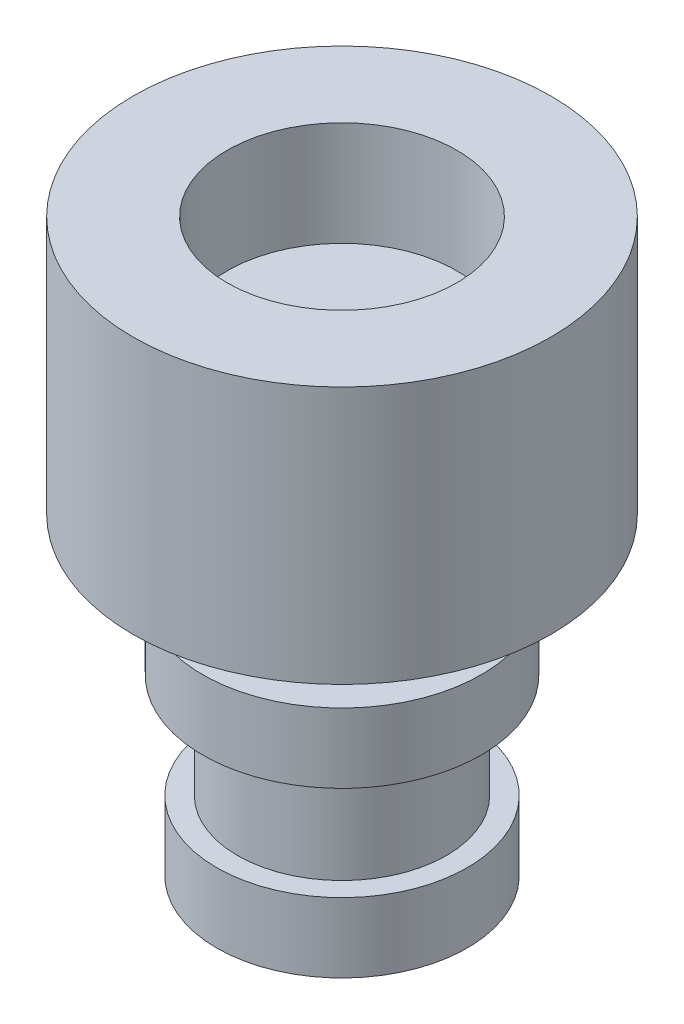
ISO-10303-21;
HEADER;
FILE_DESCRIPTION(('STEP AP214'),'2;1');
FILE_NAME('part.step','',(''),(''),'','','');
FILE_SCHEMA(('AUTOMOTIVE_DESIGN { 1 0 10303 214 1 1 1 1 }'));
ENDSEC;
DATA;
#1=APPLICATION_CONTEXT('core data for automotive mechanical design processes');
#2=APPLICATION_PROTOCOL_DEFINITION('international standard','automotive_design',2000,#1);
#3=PRODUCT_CONTEXT('',#1,'mechanical');
#4=PRODUCT('Part','Part','',(#3));
#5=PRODUCT_RELATED_PRODUCT_CATEGORY('part','',(#4));
#6=PRODUCT_DEFINITION_FORMATION('','',#4);
#7=PRODUCT_DEFINITION_CONTEXT('part definition',#1,'design');
#8=PRODUCT_DEFINITION('design','',#6,#7);
#9=PRODUCT_DEFINITION_SHAPE('','',#8);
#10=(LENGTH_UNIT() NAMED_UNIT(*) SI_UNIT(.MILLI.,.METRE.));
#11=(NAMED_UNIT(*) PLANE_ANGLE_UNIT() SI_UNIT($,.RADIAN.));
#12=(NAMED_UNIT(*) SI_UNIT($,.STERADIAN.) SOLID_ANGLE_UNIT());
#13=UNCERTAINTY_MEASURE_WITH_UNIT(LENGTH_MEASURE(1.E-05),#10,'distance_accuracy_value','');
#14=(GEOMETRIC_REPRESENTATION_CONTEXT(3) GLOBAL_UNCERTAINTY_ASSIGNED_CONTEXT((#13)) GLOBAL_UNIT_ASSIGNED_CONTEXT((#10,
#11,#12)) REPRESENTATION_CONTEXT('',''));
#15=CARTESIAN_POINT('',(0.,0.,0.));
#16=DIRECTION('',(0.,0.,1.));
#17=DIRECTION('',(1.,0.,0.));
#18=AXIS2_PLACEMENT_3D('',#15,#16,#17);
#19=CARTESIAN_POINT('',(-0.522013311509166,-4.5,-0.51113803418606));
#20=DIRECTION('',(0.,1.,0.));
#21=DIRECTION('',(0.,0.,1.));
#22=AXIS2_PLACEMENT_3D('',#19,#20,#21);
#23=CYLINDRICAL_SURFACE('',#22,1.5);
#24=CARTESIAN_POINT('',(-0.522013311509166,-2.,-0.51113803418606));
#25=DIRECTION('',(0.,-1.,0.));
#26=DIRECTION('',(0.,0.,-1.));
#27=AXIS2_PLACEMENT_3D('',#24,#25,#26);
#28=CIRCLE('',#27,1.5);
#29=CARTESIAN_POINT('',(-0.522013311509166,-2.,-2.01113803418606));
#30=VERTEX_POINT('',#29);
#31=EDGE_CURVE('E53',#30,#30,#28,.T.);
#32=ORIENTED_EDGE('',*,*,#31,.T.);
#33=EDGE_LOOP('',(#32));
#34=FACE_BOUND('',#33,.T.);
#35=CARTESIAN_POINT('',(-0.522013311509166,-3.5,-0.51113803418606));
#36=DIRECTION('',(0.,-1.,0.));
#37=DIRECTION('',(0.,0.,-1.));
#38=AXIS2_PLACEMENT_3D('',#35,#36,#37);
#39=CIRCLE('',#38,1.5);
#40=CARTESIAN_POINT('',(-0.522013311509166,-3.5,-2.01113803418606));
#41=VERTEX_POINT('',#40);
#42=EDGE_CURVE('E10',#41,#41,#39,.T.);
#43=ORIENTED_EDGE('',*,*,#42,.F.);
#44=EDGE_LOOP('',(#43));
#45=FACE_BOUND('',#44,.T.);
#46=ADVANCED_FACE('F45',(#34,#45),#23,.T.);
#47=CARTESIAN_POINT('',(-0.522013311509166,3.7,-0.51113803418606));
#48=DIRECTION('',(0.,-1.,0.));
#49=DIRECTION('',(0.,0.,-1.));
#50=AXIS2_PLACEMENT_3D('',#47,#48,#49);
#51=CYLINDRICAL_SURFACE('',#50,3.);
#52=CARTESIAN_POINT('',(-0.522013311509166,3.7,-0.51113803418606));
#53=DIRECTION('',(0.,1.,0.));
#54=DIRECTION('',(0.,0.,1.));
#55=AXIS2_PLACEMENT_3D('',#52,#53,#54);
#56=CIRCLE('',#55,3.);
#57=CARTESIAN_POINT('',(-0.522013311509166,3.7,2.48886196581394));
#58=VERTEX_POINT('',#57);
#59=EDGE_CURVE('E64',#58,#58,#56,.T.);
#60=ORIENTED_EDGE('',*,*,#59,.F.);
#61=EDGE_LOOP('',(#60));
#62=FACE_BOUND('',#61,.T.);
#63=CARTESIAN_POINT('',(-0.522013311509166,0.,-0.51113803418606));
#64=DIRECTION('',(0.,1.,0.));
#65=DIRECTION('',(0.,0.,1.));
#66=AXIS2_PLACEMENT_3D('',#63,#64,#65);
#67=CIRCLE('',#66,3.);
#68=CARTESIAN_POINT('',(-0.522013311509166,0.,2.48886196581394));
#69=VERTEX_POINT('',#68);
#70=EDGE_CURVE('E82',#69,#69,#67,.T.);
#71=ORIENTED_EDGE('',*,*,#70,.T.);
#72=EDGE_LOOP('',(#71));
#73=FACE_BOUND('',#72,.T.);
#74=ADVANCED_FACE('F47',(#62,#73),#51,.T.);
#75=CARTESIAN_POINT('',(-0.522013311509166,3.7,-0.51113803418606));
#76=DIRECTION('',(0.,1.,0.));
#77=DIRECTION('',(0.,0.,1.));
#78=AXIS2_PLACEMENT_3D('',#75,#76,#77);
#79=PLANE('',#78);
#80=CARTESIAN_POINT('',(-0.522013311509166,3.7,-0.51113803418606));
#81=DIRECTION('',(0.,1.,0.));
#82=DIRECTION('',(0.,0.,1.));
#83=AXIS2_PLACEMENT_3D('',#80,#81,#82);
#84=CIRCLE('',#83,1.65);
#85=CARTESIAN_POINT('',(-0.522013311509166,3.7,1.13886196581394));
#86=VERTEX_POINT('',#85);
#87=EDGE_CURVE('E255',#86,#86,#84,.T.);
#88=ORIENTED_EDGE('',*,*,#87,.F.);
#89=EDGE_LOOP('',(#88));
#90=FACE_BOUND('',#89,.T.);
#91=ORIENTED_EDGE('',*,*,#59,.T.);
#92=EDGE_LOOP('',(#91));
#93=FACE_BOUND('',#92,.T.);
#94=ADVANCED_FACE('F94',(#90,#93),#79,.T.);
#95=CARTESIAN_POINT('',(-0.522013311509166,0.,-0.51113803418606));
#96=DIRECTION('',(0.,1.,0.));
#97=DIRECTION('',(0.,0.,1.));
#98=AXIS2_PLACEMENT_3D('',#95,#96,#97);
#99=PLANE('',#98);
#100=CARTESIAN_POINT('',(-0.522013311509166,0.,-0.51113803418606));
#101=DIRECTION('',(0.,-1.,0.));
#102=DIRECTION('',(0.,0.,-1.));
#103=AXIS2_PLACEMENT_3D('',#100,#101,#102);
#104=CIRCLE('',#103,1.5);
#105=CARTESIAN_POINT('',(-0.522013311509166,0.,-2.01113803418606));
#106=VERTEX_POINT('',#105);
#107=EDGE_CURVE('E58',#106,#106,#104,.T.);
#108=ORIENTED_EDGE('',*,*,#107,.F.);
#109=EDGE_LOOP('',(#108));
#110=FACE_BOUND('',#109,.T.);
#111=ORIENTED_EDGE('',*,*,#70,.F.);
#112=EDGE_LOOP('',(#111));
#113=FACE_BOUND('',#112,.T.);
#114=ADVANCED_FACE('F91',(#110,#113),#99,.F.);
#115=CARTESIAN_POINT('',(-0.522013311509166,-1.,-0.51113803418606));
#116=DIRECTION('',(0.,1.,0.));
#117=DIRECTION('',(0.,0.,1.));
#118=AXIS2_PLACEMENT_3D('',#115,#116,#117);
#119=CYLINDRICAL_SURFACE('',#118,1.5);
#120=CARTESIAN_POINT('',(-0.522013311509166,-1.,-0.51113803418606));
#121=DIRECTION('',(0.,-1.,0.));
#122=DIRECTION('',(0.,0.,-1.));
#123=AXIS2_PLACEMENT_3D('',#120,#121,#122);
#124=CIRCLE('',#123,1.5);
#125=CARTESIAN_POINT('',(-0.522013311509166,-1.,-2.01113803418606));
#126=VERTEX_POINT('',#125);
#127=EDGE_CURVE('E74',#126,#126,#124,.T.);
#128=ORIENTED_EDGE('',*,*,#127,.F.);
#129=EDGE_LOOP('',(#128));
#130=FACE_BOUND('',#129,.T.);
#131=ORIENTED_EDGE('',*,*,#107,.T.);
#132=EDGE_LOOP('',(#131));
#133=FACE_BOUND('',#132,.T.);
#134=ADVANCED_FACE('F93',(#130,#133),#119,.T.);
#135=CARTESIAN_POINT('',(-0.522013311509166,-2.,-0.51113803418606));
#136=DIRECTION('',(0.,1.,0.));
#137=DIRECTION('',(0.,0.,1.));
#138=AXIS2_PLACEMENT_3D('',#135,#136,#137);
#139=CYLINDRICAL_SURFACE('',#138,2.);
#140=CARTESIAN_POINT('',(-0.522013311509166,-2.,-0.51113803418606));
#141=DIRECTION('',(0.,-1.,0.));
#142=DIRECTION('',(0.,0.,-1.));
#143=AXIS2_PLACEMENT_3D('',#140,#141,#142);
#144=CIRCLE('',#143,2.);
#145=CARTESIAN_POINT('',(-0.522013311509166,-2.,-2.51113803418606));
#146=VERTEX_POINT('',#145);
#147=EDGE_CURVE('E70',#146,#146,#144,.T.);
#148=ORIENTED_EDGE('',*,*,#147,.F.);
#149=EDGE_LOOP('',(#148));
#150=FACE_BOUND('',#149,.T.);
#151=CARTESIAN_POINT('',(-0.522013311509166,-1.,-0.51113803418606));
#152=DIRECTION('',(0.,-1.,0.));
#153=DIRECTION('',(0.,0.,-1.));
#154=AXIS2_PLACEMENT_3D('',#151,#152,#153);
#155=CIRCLE('',#154,2.);
#156=CARTESIAN_POINT('',(-0.522013311509166,-1.,-2.51113803418606));
#157=VERTEX_POINT('',#156);
#158=EDGE_CURVE('E75',#157,#157,#155,.T.);
#159=ORIENTED_EDGE('',*,*,#158,.T.);
#160=EDGE_LOOP('',(#159));
#161=FACE_BOUND('',#160,.T.);
#162=ADVANCED_FACE('F100',(#150,#161),#139,.T.);
#163=CARTESIAN_POINT('',(-0.522013311509166,-2.,-0.51113803418606));
#164=DIRECTION('',(0.,-1.,0.));
#165=DIRECTION('',(0.,0.,-1.));
#166=AXIS2_PLACEMENT_3D('',#163,#164,#165);
#167=PLANE('',#166);
#168=ORIENTED_EDGE('',*,*,#31,.F.);
#169=EDGE_LOOP('',(#168));
#170=FACE_BOUND('',#169,.T.);
#171=ORIENTED_EDGE('',*,*,#147,.T.);
#172=EDGE_LOOP('',(#171));
#173=FACE_BOUND('',#172,.T.);
#174=ADVANCED_FACE('F117',(#170,#173),#167,.T.);
#175=CARTESIAN_POINT('',(-0.522013311509166,-1.,-0.51113803418606));
#176=DIRECTION('',(0.,-1.,0.));
#177=DIRECTION('',(0.,0.,-1.));
#178=AXIS2_PLACEMENT_3D('',#175,#176,#177);
#179=PLANE('',#178);
#180=ORIENTED_EDGE('',*,*,#127,.T.);
#181=EDGE_LOOP('',(#180));
#182=FACE_BOUND('',#181,.T.);
#183=ORIENTED_EDGE('',*,*,#158,.F.);
#184=EDGE_LOOP('',(#183));
#185=FACE_BOUND('',#184,.T.);
#186=ADVANCED_FACE('F120',(#182,#185),#179,.F.);
#187=CARTESIAN_POINT('',(-0.522013311509166,-3.5,-0.51113803418606));
#188=DIRECTION('',(0.,-1.,0.));
#189=DIRECTION('',(0.,0.,-1.));
#190=AXIS2_PLACEMENT_3D('',#187,#188,#189);
#191=CYLINDRICAL_SURFACE('',#190,1.8);
#192=CARTESIAN_POINT('',(-0.522013311509166,-3.5,-0.51113803418606));
#193=DIRECTION('',(0.,-1.,0.));
#194=DIRECTION('',(0.,0.,-1.));
#195=AXIS2_PLACEMENT_3D('',#192,#193,#194);
#196=CIRCLE('',#195,1.8);
#197=CARTESIAN_POINT('',(-0.522013311509166,-3.5,-2.31113803418606));
#198=VERTEX_POINT('',#197);
#199=EDGE_CURVE('E79',#198,#198,#196,.T.);
#200=ORIENTED_EDGE('',*,*,#199,.T.);
#201=EDGE_LOOP('',(#200));
#202=FACE_BOUND('',#201,.T.);
#203=CARTESIAN_POINT('',(-0.522013311509166,-4.5,-0.51113803418606));
#204=DIRECTION('',(0.,-1.,0.));
#205=DIRECTION('',(0.,0.,-1.));
#206=AXIS2_PLACEMENT_3D('',#203,#204,#205);
#207=CIRCLE('',#206,1.8);
#208=CARTESIAN_POINT('',(-0.522013311509166,-4.5,-2.31113803418606));
#209=VERTEX_POINT('',#208);
#210=EDGE_CURVE('E68',#209,#209,#207,.T.);
#211=ORIENTED_EDGE('',*,*,#210,.F.);
#212=EDGE_LOOP('',(#211));
#213=FACE_BOUND('',#212,.T.);
#214=ADVANCED_FACE('F124',(#202,#213),#191,.T.);
#215=CARTESIAN_POINT('',(-0.522013311509166,-3.5,-0.51113803418606));
#216=DIRECTION('',(0.,-1.,0.));
#217=DIRECTION('',(0.,0.,-1.));
#218=AXIS2_PLACEMENT_3D('',#215,#216,#217);
#219=PLANE('',#218);
#220=ORIENTED_EDGE('',*,*,#42,.T.);
#221=EDGE_LOOP('',(#220));
#222=FACE_BOUND('',#221,.T.);
#223=ORIENTED_EDGE('',*,*,#199,.F.);
#224=EDGE_LOOP('',(#223));
#225=FACE_BOUND('',#224,.T.);
#226=ADVANCED_FACE('F151',(#222,#225),#219,.F.);
#227=CARTESIAN_POINT('',(-0.522013311509166,-4.5,-0.51113803418606));
#228=DIRECTION('',(0.,-1.,0.));
#229=DIRECTION('',(0.,0.,-1.));
#230=AXIS2_PLACEMENT_3D('',#227,#228,#229);
#231=PLANE('',#230);
#232=ORIENTED_EDGE('',*,*,#210,.T.);
#233=EDGE_LOOP('',(#232));
#234=FACE_BOUND('',#233,.T.);
#235=ADVANCED_FACE('F115',(#234),#231,.T.);
#236=CARTESIAN_POINT('',(-0.522013311509166,2.2,-0.51113803418606));
#237=DIRECTION('',(0.,1.,0.));
#238=DIRECTION('',(0.,0.,1.));
#239=AXIS2_PLACEMENT_3D('',#236,#237,#238);
#240=CYLINDRICAL_SURFACE('',#239,1.65);
#241=CARTESIAN_POINT('',(-0.522013311509166,2.2,-0.51113803418606));
#242=DIRECTION('',(0.,1.,0.));
#243=DIRECTION('',(0.,0.,1.));
#244=AXIS2_PLACEMENT_3D('',#241,#242,#243);
#245=CIRCLE('',#244,1.65);
#246=CARTESIAN_POINT('',(-0.522013311509166,2.2,1.13886196581394));
#247=VERTEX_POINT('',#246);
#248=EDGE_CURVE('E253',#247,#247,#245,.T.);
#249=ORIENTED_EDGE('',*,*,#248,.F.);
#250=EDGE_LOOP('',(#249));
#251=FACE_BOUND('',#250,.T.);
#252=ORIENTED_EDGE('',*,*,#87,.T.);
#253=EDGE_LOOP('',(#252));
#254=FACE_BOUND('',#253,.T.);
#255=ADVANCED_FACE('F164',(#251,#254),#240,.F.);
#256=CARTESIAN_POINT('',(-0.522013311509166,2.2,-0.51113803418606));
#257=DIRECTION('',(0.,1.,0.));
#258=DIRECTION('',(0.,0.,1.));
#259=AXIS2_PLACEMENT_3D('',#256,#257,#258);
#260=PLANE('',#259);
#261=ORIENTED_EDGE('',*,*,#248,.T.);
#262=EDGE_LOOP('',(#261));
#263=FACE_BOUND('',#262,.T.);
#264=ADVANCED_FACE('F172',(#263),#260,.T.);
#265=CLOSED_SHELL('',(#46,#74,#94,#114,#134,#162,#174,#186,#214,#226,#235,#255,#264));
#266=MANIFOLD_SOLID_BREP('B2',#265);
#267=ADVANCED_BREP_SHAPE_REPRESENTATION('',(#18,#266),#14);
#268=SHAPE_DEFINITION_REPRESENTATION(#9,#267);
ENDSEC;
END-ISO-10303-21;
